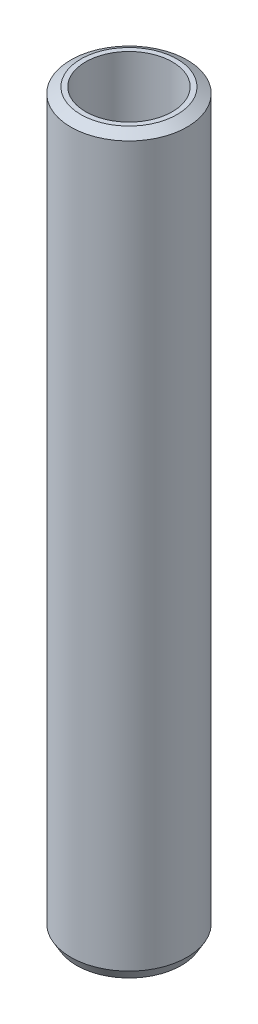
ISO-10303-21;
HEADER;
FILE_DESCRIPTION(('STEP AP214'),'2;1');
FILE_NAME('part.step','',(''),(''),'','','');
FILE_SCHEMA(('AUTOMOTIVE_DESIGN { 1 0 10303 214 1 1 1 1 }'));
ENDSEC;
DATA;
#1=APPLICATION_CONTEXT('core data for automotive mechanical design processes');
#2=APPLICATION_PROTOCOL_DEFINITION('international standard','automotive_design',2000,#1);
#3=PRODUCT_CONTEXT('',#1,'mechanical');
#4=PRODUCT('Part','Part','',(#3));
#5=PRODUCT_RELATED_PRODUCT_CATEGORY('part','',(#4));
#6=PRODUCT_DEFINITION_FORMATION('','',#4);
#7=PRODUCT_DEFINITION_CONTEXT('part definition',#1,'design');
#8=PRODUCT_DEFINITION('design','',#6,#7);
#9=PRODUCT_DEFINITION_SHAPE('','',#8);
#10=(LENGTH_UNIT() NAMED_UNIT(*) SI_UNIT(.MILLI.,.METRE.));
#11=(NAMED_UNIT(*) PLANE_ANGLE_UNIT() SI_UNIT($,.RADIAN.));
#12=(NAMED_UNIT(*) SI_UNIT($,.STERADIAN.) SOLID_ANGLE_UNIT());
#13=UNCERTAINTY_MEASURE_WITH_UNIT(LENGTH_MEASURE(1.E-05),#10,'distance_accuracy_value','');
#14=(GEOMETRIC_REPRESENTATION_CONTEXT(3) GLOBAL_UNCERTAINTY_ASSIGNED_CONTEXT((#13)) GLOBAL_UNIT_ASSIGNED_CONTEXT((#10,
#11,#12)) REPRESENTATION_CONTEXT('',''));
#15=CARTESIAN_POINT('',(0.,0.,0.));
#16=DIRECTION('',(0.,0.,1.));
#17=DIRECTION('',(1.,0.,0.));
#18=AXIS2_PLACEMENT_3D('',#15,#16,#17);
#19=CARTESIAN_POINT('',(0.,600.,0.));
#20=DIRECTION('',(0.,-1.,0.));
#21=DIRECTION('',(0.,0.,-1.));
#22=AXIS2_PLACEMENT_3D('',#19,#20,#21);
#23=CYLINDRICAL_SURFACE('',#22,47.5);
#24=CARTESIAN_POINT('',(0.,595.264888552296,0.));
#25=DIRECTION('',(0.,1.,0.));
#26=DIRECTION('',(0.,0.,1.));
#27=AXIS2_PLACEMENT_3D('',#24,#25,#26);
#28=CIRCLE('',#27,47.5);
#29=CARTESIAN_POINT('',(0.,595.264888552296,47.5));
#30=VERTEX_POINT('',#29);
#31=EDGE_CURVE('E50',#30,#30,#28,.F.);
#32=ORIENTED_EDGE('',*,*,#31,.T.);
#33=EDGE_LOOP('',(#32));
#34=FACE_BOUND('',#33,.T.);
#35=CARTESIAN_POINT('',(0.,8.20145360692337,0.));
#36=DIRECTION('',(0.,1.,0.));
#37=DIRECTION('',(0.,0.,1.));
#38=AXIS2_PLACEMENT_3D('',#35,#36,#37);
#39=CIRCLE('',#38,47.5);
#40=CARTESIAN_POINT('',(0.,8.20145360692337,47.5));
#41=VERTEX_POINT('',#40);
#42=EDGE_CURVE('E51',#41,#41,#39,.T.);
#43=ORIENTED_EDGE('',*,*,#42,.T.);
#44=EDGE_LOOP('',(#43));
#45=FACE_BOUND('',#44,.T.);
#46=ADVANCED_FACE('F39',(#34,#45),#23,.T.);
#47=CARTESIAN_POINT('',(0.,600.,0.));
#48=DIRECTION('',(0.,1.,0.));
#49=DIRECTION('',(0.,0.,1.));
#50=AXIS2_PLACEMENT_3D('',#47,#48,#49);
#51=PLANE('',#50);
#52=CARTESIAN_POINT('',(0.,600.,0.));
#53=DIRECTION('',(0.,1.,0.));
#54=DIRECTION('',(0.,0.,1.));
#55=AXIS2_PLACEMENT_3D('',#52,#53,#54);
#56=CIRCLE('',#55,39.2985463930766);
#57=CARTESIAN_POINT('',(0.,600.,39.2985463930766));
#58=VERTEX_POINT('',#57);
#59=EDGE_CURVE('E54',#58,#58,#56,.T.);
#60=ORIENTED_EDGE('',*,*,#59,.T.);
#61=EDGE_LOOP('',(#60));
#62=FACE_BOUND('',#61,.T.);
#63=CARTESIAN_POINT('',(0.,600.,0.));
#64=DIRECTION('',(0.,1.,0.));
#65=DIRECTION('',(0.,0.,1.));
#66=AXIS2_PLACEMENT_3D('',#63,#64,#65);
#67=CIRCLE('',#66,35.3493024694411);
#68=CARTESIAN_POINT('',(0.,600.,35.3493024694411));
#69=VERTEX_POINT('',#68);
#70=EDGE_CURVE('E58',#69,#69,#67,.T.);
#71=ORIENTED_EDGE('',*,*,#70,.F.);
#72=EDGE_LOOP('',(#71));
#73=FACE_BOUND('',#72,.T.);
#74=ADVANCED_FACE('F69',(#62,#73),#51,.T.);
#75=CARTESIAN_POINT('',(0.,0.,0.));
#76=DIRECTION('',(0.,1.,0.));
#77=DIRECTION('',(0.,0.,1.));
#78=AXIS2_PLACEMENT_3D('',#75,#76,#77);
#79=PLANE('',#78);
#80=CARTESIAN_POINT('',(0.,0.,0.));
#81=DIRECTION('',(0.,1.,0.));
#82=DIRECTION('',(0.,0.,1.));
#83=AXIS2_PLACEMENT_3D('',#80,#81,#82);
#84=CIRCLE('',#83,42.7648885522965);
#85=CARTESIAN_POINT('',(0.,0.,42.7648885522965));
#86=VERTEX_POINT('',#85);
#87=EDGE_CURVE('E10',#86,#86,#84,.F.);
#88=ORIENTED_EDGE('',*,*,#87,.T.);
#89=EDGE_LOOP('',(#88));
#90=FACE_BOUND('',#89,.T.);
#91=CARTESIAN_POINT('',(0.,0.,0.));
#92=DIRECTION('',(0.,1.,0.));
#93=DIRECTION('',(0.,0.,1.));
#94=AXIS2_PLACEMENT_3D('',#91,#92,#93);
#95=CIRCLE('',#94,35.3493024694411);
#96=CARTESIAN_POINT('',(0.,0.,35.3493024694411));
#97=VERTEX_POINT('',#96);
#98=EDGE_CURVE('E63',#97,#97,#95,.T.);
#99=ORIENTED_EDGE('',*,*,#98,.T.);
#100=EDGE_LOOP('',(#99));
#101=FACE_BOUND('',#100,.T.);
#102=ADVANCED_FACE('F75',(#90,#101),#79,.F.);
#103=CARTESIAN_POINT('',(0.,600.,0.));
#104=DIRECTION('',(0.,-1.,0.));
#105=DIRECTION('',(0.,0.,-1.));
#106=AXIS2_PLACEMENT_3D('',#103,#104,#105);
#107=CYLINDRICAL_SURFACE('',#106,35.3493024694411);
#108=ORIENTED_EDGE('',*,*,#70,.T.);
#109=EDGE_LOOP('',(#108));
#110=FACE_BOUND('',#109,.T.);
#111=ORIENTED_EDGE('',*,*,#98,.F.);
#112=EDGE_LOOP('',(#111));
#113=FACE_BOUND('',#112,.T.);
#114=ADVANCED_FACE('F70',(#110,#113),#107,.F.);
#115=CARTESIAN_POINT('',(0.,600.,0.));
#116=DIRECTION('',(0.,-1.,0.));
#117=DIRECTION('',(0.,0.,-1.));
#118=AXIS2_PLACEMENT_3D('',#115,#116,#117);
#119=CONICAL_SURFACE('',#118,39.2985463930766,1.04719755119659);
#120=ORIENTED_EDGE('',*,*,#31,.F.);
#121=EDGE_LOOP('',(#120));
#122=FACE_BOUND('',#121,.T.);
#123=ORIENTED_EDGE('',*,*,#59,.F.);
#124=EDGE_LOOP('',(#123));
#125=FACE_BOUND('',#124,.T.);
#126=ADVANCED_FACE('F81',(#122,#125),#119,.T.);
#127=CARTESIAN_POINT('',(0.,8.20145360692337,0.));
#128=DIRECTION('',(0.,1.,0.));
#129=DIRECTION('',(0.,0.,1.));
#130=AXIS2_PLACEMENT_3D('',#127,#128,#129);
#131=CONICAL_SURFACE('',#130,47.5,0.523598775598307);
#132=ORIENTED_EDGE('',*,*,#87,.F.);
#133=EDGE_LOOP('',(#132));
#134=FACE_BOUND('',#133,.T.);
#135=ORIENTED_EDGE('',*,*,#42,.F.);
#136=EDGE_LOOP('',(#135));
#137=FACE_BOUND('',#136,.T.);
#138=ADVANCED_FACE('F45',(#134,#137),#131,.T.);
#139=CLOSED_SHELL('',(#46,#74,#102,#114,#126,#138));
#140=MANIFOLD_SOLID_BREP('B2',#139);
#141=ADVANCED_BREP_SHAPE_REPRESENTATION('',(#18,#140),#14);
#142=SHAPE_DEFINITION_REPRESENTATION(#9,#141);
ENDSEC;
END-ISO-10303-21;
